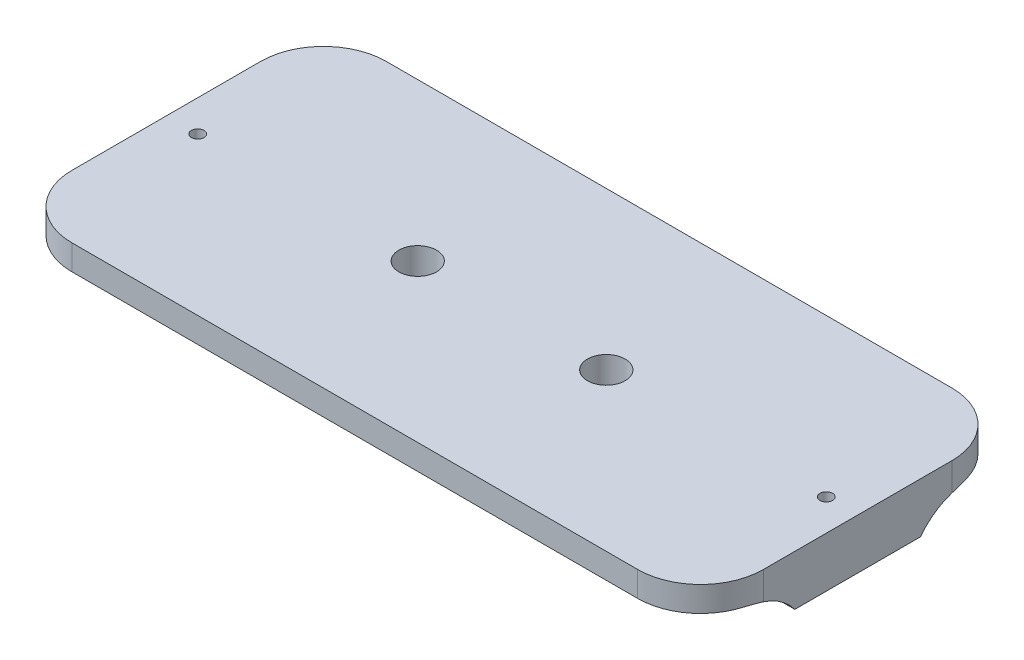
ISO-10303-21;
HEADER;
FILE_DESCRIPTION(('STEP AP214'),'2;1');
FILE_NAME('part.step','',(''),(''),'','','');
FILE_SCHEMA(('AUTOMOTIVE_DESIGN { 1 0 10303 214 1 1 1 1 }'));
ENDSEC;
DATA;
#1=APPLICATION_CONTEXT('core data for automotive mechanical design processes');
#2=APPLICATION_PROTOCOL_DEFINITION('international standard','automotive_design',2000,#1);
#3=PRODUCT_CONTEXT('',#1,'mechanical');
#4=PRODUCT('Part','Part','',(#3));
#5=PRODUCT_RELATED_PRODUCT_CATEGORY('part','',(#4));
#6=PRODUCT_DEFINITION_FORMATION('','',#4);
#7=PRODUCT_DEFINITION_CONTEXT('part definition',#1,'design');
#8=PRODUCT_DEFINITION('design','',#6,#7);
#9=PRODUCT_DEFINITION_SHAPE('','',#8);
#10=(LENGTH_UNIT() NAMED_UNIT(*) SI_UNIT(.MILLI.,.METRE.));
#11=(NAMED_UNIT(*) PLANE_ANGLE_UNIT() SI_UNIT($,.RADIAN.));
#12=(NAMED_UNIT(*) SI_UNIT($,.STERADIAN.) SOLID_ANGLE_UNIT());
#13=UNCERTAINTY_MEASURE_WITH_UNIT(LENGTH_MEASURE(1.E-05),#10,'distance_accuracy_value','');
#14=(GEOMETRIC_REPRESENTATION_CONTEXT(3) GLOBAL_UNCERTAINTY_ASSIGNED_CONTEXT((#13)) GLOBAL_UNIT_ASSIGNED_CONTEXT((#10,
#11,#12)) REPRESENTATION_CONTEXT('',''));
#15=CARTESIAN_POINT('',(0.,0.,0.));
#16=DIRECTION('',(0.,0.,1.));
#17=DIRECTION('',(1.,0.,0.));
#18=AXIS2_PLACEMENT_3D('',#15,#16,#17);
#19=CARTESIAN_POINT('',(0.,0.,0.));
#20=DIRECTION('',(0.,-1.,0.));
#21=DIRECTION('',(0.,0.,-1.));
#22=AXIS2_PLACEMENT_3D('',#19,#20,#21);
#23=PLANE('',#22);
#24=CARTESIAN_POINT('',(4.99999999999999,0.,-25.));
#25=DIRECTION('',(0.,1.,0.));
#26=DIRECTION('',(0.,0.,1.));
#27=AXIS2_PLACEMENT_3D('',#24,#25,#26);
#28=CIRCLE('',#27,1.);
#29=CARTESIAN_POINT('',(4.99999999999999,0.,-24.));
#30=VERTEX_POINT('',#29);
#31=EDGE_CURVE('E318',#30,#30,#28,.T.);
#32=ORIENTED_EDGE('',*,*,#31,.T.);
#33=EDGE_LOOP('',(#32));
#34=FACE_BOUND('',#33,.T.);
#35=CARTESIAN_POINT('',(105.,0.,-25.));
#36=DIRECTION('',(0.,1.,0.));
#37=DIRECTION('',(0.,0.,1.));
#38=AXIS2_PLACEMENT_3D('',#35,#36,#37);
#39=CIRCLE('',#38,0.999999999999998);
#40=CARTESIAN_POINT('',(105.,0.,-24.));
#41=VERTEX_POINT('',#40);
#42=EDGE_CURVE('E326',#41,#41,#39,.T.);
#43=ORIENTED_EDGE('',*,*,#42,.T.);
#44=EDGE_LOOP('',(#43));
#45=FACE_BOUND('',#44,.T.);
#46=CARTESIAN_POINT('',(70.,0.,-25.));
#47=DIRECTION('',(0.,1.,0.));
#48=DIRECTION('',(0.,0.,1.));
#49=AXIS2_PLACEMENT_3D('',#46,#47,#48);
#50=CIRCLE('',#49,1.75);
#51=CARTESIAN_POINT('',(70.,0.,-23.25));
#52=VERTEX_POINT('',#51);
#53=EDGE_CURVE('E300',#52,#52,#50,.T.);
#54=ORIENTED_EDGE('',*,*,#53,.T.);
#55=EDGE_LOOP('',(#54));
#56=FACE_BOUND('',#55,.T.);
#57=CARTESIAN_POINT('',(40.,0.,-25.));
#58=DIRECTION('',(0.,1.,0.));
#59=DIRECTION('',(0.,0.,1.));
#60=AXIS2_PLACEMENT_3D('',#57,#58,#59);
#61=CIRCLE('',#60,1.75);
#62=CARTESIAN_POINT('',(40.,0.,-23.25));
#63=VERTEX_POINT('',#62);
#64=EDGE_CURVE('E294',#63,#63,#61,.T.);
#65=ORIENTED_EDGE('',*,*,#64,.T.);
#66=EDGE_LOOP('',(#65));
#67=FACE_BOUND('',#66,.T.);
#68=DIRECTION('',(0.,0.,1.));
#69=VECTOR('',#68,1.);
#70=CARTESIAN_POINT('',(0.,0.,0.));
#71=LINE('',#70,#69);
#72=CARTESIAN_POINT('',(0.,0.,-35.));
#73=VERTEX_POINT('',#72);
#74=CARTESIAN_POINT('',(0.,0.,-15.));
#75=VERTEX_POINT('',#74);
#76=EDGE_CURVE('E141',#73,#75,#71,.T.);
#77=ORIENTED_EDGE('',*,*,#76,.F.);
#78=DIRECTION('',(-1.,0.,0.));
#79=VECTOR('',#78,1.);
#80=CARTESIAN_POINT('',(110.,0.,-35.));
#81=LINE('',#80,#79);
#82=CARTESIAN_POINT('',(110.,0.,-35.));
#83=VERTEX_POINT('',#82);
#84=EDGE_CURVE('E135',#83,#73,#81,.T.);
#85=ORIENTED_EDGE('',*,*,#84,.F.);
#86=DIRECTION('',(0.,0.,-1.));
#87=VECTOR('',#86,1.);
#88=CARTESIAN_POINT('',(110.,0.,0.));
#89=LINE('',#88,#87);
#90=CARTESIAN_POINT('',(110.,0.,-15.));
#91=VERTEX_POINT('',#90);
#92=EDGE_CURVE('E138',#91,#83,#89,.T.);
#93=ORIENTED_EDGE('',*,*,#92,.F.);
#94=DIRECTION('',(-1.,0.,0.));
#95=VECTOR('',#94,1.);
#96=CARTESIAN_POINT('',(110.,0.,-15.));
#97=LINE('',#96,#95);
#98=EDGE_CURVE('E246',#91,#75,#97,.T.);
#99=ORIENTED_EDGE('',*,*,#98,.T.);
#100=EDGE_LOOP('',(#77,#85,#93,#99));
#101=FACE_BOUND('',#100,.T.);
#102=ADVANCED_FACE('F39',(#34,#45,#56,#67,#101),#23,.T.);
#103=CARTESIAN_POINT('',(0.,8.,0.));
#104=DIRECTION('',(1.,0.,0.));
#105=DIRECTION('',(0.,0.,-1.));
#106=AXIS2_PLACEMENT_3D('',#103,#104,#105);
#107=PLANE('',#106);
#108=DIRECTION('',(0.,-1.,0.));
#109=VECTOR('',#108,1.);
#110=CARTESIAN_POINT('',(0.,8.,-40.));
#111=LINE('',#110,#109);
#112=CARTESIAN_POINT('',(0.,8.,-40.));
#113=VERTEX_POINT('',#112);
#114=CARTESIAN_POINT('',(0.,3.53939201416947,-40.));
#115=VERTEX_POINT('',#114);
#116=EDGE_CURVE('E67',#113,#115,#111,.T.);
#117=ORIENTED_EDGE('',*,*,#116,.T.);
#118=CARTESIAN_POINT('',(0.,-6.,-43.));
#119=DIRECTION('',(1.,0.,0.));
#120=DIRECTION('',(0.,0.,-1.));
#121=AXIS2_PLACEMENT_3D('',#118,#119,#120);
#122=CIRCLE('',#121,10.);
#123=EDGE_CURVE('E156',#115,#73,#122,.T.);
#124=ORIENTED_EDGE('',*,*,#123,.T.);
#125=ORIENTED_EDGE('',*,*,#76,.T.);
#126=CARTESIAN_POINT('',(0.,-6.,-7.));
#127=DIRECTION('',(1.,0.,0.));
#128=DIRECTION('',(0.,0.,-1.));
#129=AXIS2_PLACEMENT_3D('',#126,#127,#128);
#130=CIRCLE('',#129,10.);
#131=CARTESIAN_POINT('',(0.,3.53939201416947,-10.));
#132=VERTEX_POINT('',#131);
#133=EDGE_CURVE('E265',#75,#132,#130,.T.);
#134=ORIENTED_EDGE('',*,*,#133,.T.);
#135=DIRECTION('',(0.,-1.,0.));
#136=VECTOR('',#135,1.);
#137=CARTESIAN_POINT('',(0.,8.,-10.));
#138=LINE('',#137,#136);
#139=CARTESIAN_POINT('',(0.,8.,-10.));
#140=VERTEX_POINT('',#139);
#141=EDGE_CURVE('E270',#132,#140,#138,.F.);
#142=ORIENTED_EDGE('',*,*,#141,.T.);
#143=DIRECTION('',(0.,0.,1.));
#144=VECTOR('',#143,1.);
#145=CARTESIAN_POINT('',(0.,8.,0.));
#146=LINE('',#145,#144);
#147=EDGE_CURVE('E153',#113,#140,#146,.T.);
#148=ORIENTED_EDGE('',*,*,#147,.F.);
#149=EDGE_LOOP('',(#117,#124,#125,#134,#142,#148));
#150=FACE_BOUND('',#149,.T.);
#151=ADVANCED_FACE('F174',(#150),#107,.F.);
#152=CARTESIAN_POINT('',(0.,8.,0.));
#153=DIRECTION('',(0.,0.,-1.));
#154=DIRECTION('',(-1.,0.,0.));
#155=AXIS2_PLACEMENT_3D('',#152,#153,#154);
#156=PLANE('',#155);
#157=DIRECTION('',(-1.,0.,0.));
#158=VECTOR('',#157,1.);
#159=CARTESIAN_POINT('',(110.,4.,0.));
#160=LINE('',#159,#158);
#161=CARTESIAN_POINT('',(100.,4.,0.));
#162=VERTEX_POINT('',#161);
#163=CARTESIAN_POINT('',(10.,4.,0.));
#164=VERTEX_POINT('',#163);
#165=EDGE_CURVE('E146',#162,#164,#160,.T.);
#166=ORIENTED_EDGE('',*,*,#165,.F.);
#167=DIRECTION('',(0.,-1.,0.));
#168=VECTOR('',#167,1.);
#169=CARTESIAN_POINT('',(100.,8.,0.));
#170=LINE('',#169,#168);
#171=CARTESIAN_POINT('',(100.,8.,0.));
#172=VERTEX_POINT('',#171);
#173=EDGE_CURVE('E240',#162,#172,#170,.F.);
#174=ORIENTED_EDGE('',*,*,#173,.T.);
#175=DIRECTION('',(1.,0.,0.));
#176=VECTOR('',#175,1.);
#177=CARTESIAN_POINT('',(0.,8.,0.));
#178=LINE('',#177,#176);
#179=CARTESIAN_POINT('',(10.,8.,0.));
#180=VERTEX_POINT('',#179);
#181=EDGE_CURVE('E306',#180,#172,#178,.T.);
#182=ORIENTED_EDGE('',*,*,#181,.F.);
#183=DIRECTION('',(0.,-1.,0.));
#184=VECTOR('',#183,1.);
#185=CARTESIAN_POINT('',(10.,8.,0.));
#186=LINE('',#185,#184);
#187=EDGE_CURVE('E243',#180,#164,#186,.T.);
#188=ORIENTED_EDGE('',*,*,#187,.T.);
#189=EDGE_LOOP('',(#166,#174,#182,#188));
#190=FACE_BOUND('',#189,.T.);
#191=ADVANCED_FACE('F220',(#190),#156,.F.);
#192=CARTESIAN_POINT('',(110.,8.,0.));
#193=DIRECTION('',(-1.,0.,0.));
#194=DIRECTION('',(0.,0.,1.));
#195=AXIS2_PLACEMENT_3D('',#192,#193,#194);
#196=PLANE('',#195);
#197=ORIENTED_EDGE('',*,*,#92,.T.);
#198=CARTESIAN_POINT('',(110.,-6.,-43.));
#199=DIRECTION('',(-1.,0.,0.));
#200=DIRECTION('',(0.,0.,1.));
#201=AXIS2_PLACEMENT_3D('',#198,#199,#200);
#202=CIRCLE('',#201,10.);
#203=CARTESIAN_POINT('',(110.,3.53939201416947,-40.));
#204=VERTEX_POINT('',#203);
#205=EDGE_CURVE('E53',#83,#204,#202,.T.);
#206=ORIENTED_EDGE('',*,*,#205,.T.);
#207=DIRECTION('',(0.,-1.,0.));
#208=VECTOR('',#207,1.);
#209=CARTESIAN_POINT('',(110.,8.,-40.));
#210=LINE('',#209,#208);
#211=CARTESIAN_POINT('',(110.,8.,-40.));
#212=VERTEX_POINT('',#211);
#213=EDGE_CURVE('E59',#204,#212,#210,.F.);
#214=ORIENTED_EDGE('',*,*,#213,.T.);
#215=DIRECTION('',(0.,0.,-1.));
#216=VECTOR('',#215,1.);
#217=CARTESIAN_POINT('',(110.,8.,0.));
#218=LINE('',#217,#216);
#219=CARTESIAN_POINT('',(110.,8.,-10.));
#220=VERTEX_POINT('',#219);
#221=EDGE_CURVE('E303',#220,#212,#218,.T.);
#222=ORIENTED_EDGE('',*,*,#221,.F.);
#223=DIRECTION('',(0.,-1.,0.));
#224=VECTOR('',#223,1.);
#225=CARTESIAN_POINT('',(110.,8.,-10.));
#226=LINE('',#225,#224);
#227=CARTESIAN_POINT('',(110.,3.53939201416947,-10.));
#228=VERTEX_POINT('',#227);
#229=EDGE_CURVE('E272',#220,#228,#226,.T.);
#230=ORIENTED_EDGE('',*,*,#229,.T.);
#231=CARTESIAN_POINT('',(110.,-6.,-7.));
#232=DIRECTION('',(-1.,0.,0.));
#233=DIRECTION('',(0.,0.,1.));
#234=AXIS2_PLACEMENT_3D('',#231,#232,#233);
#235=CIRCLE('',#234,10.);
#236=EDGE_CURVE('E152',#228,#91,#235,.T.);
#237=ORIENTED_EDGE('',*,*,#236,.T.);
#238=EDGE_LOOP('',(#197,#206,#214,#222,#230,#237));
#239=FACE_BOUND('',#238,.T.);
#240=ADVANCED_FACE('F149',(#239),#196,.F.);
#241=CARTESIAN_POINT('',(0.,8.,-50.));
#242=DIRECTION('',(0.,0.,1.));
#243=DIRECTION('',(1.,0.,0.));
#244=AXIS2_PLACEMENT_3D('',#241,#242,#243);
#245=PLANE('',#244);
#246=DIRECTION('',(-1.,0.,0.));
#247=VECTOR('',#246,1.);
#248=CARTESIAN_POINT('',(110.,4.,-50.));
#249=LINE('',#248,#247);
#250=CARTESIAN_POINT('',(100.,4.,-50.));
#251=VERTEX_POINT('',#250);
#252=CARTESIAN_POINT('',(10.,4.,-50.));
#253=VERTEX_POINT('',#252);
#254=EDGE_CURVE('E145',#251,#253,#249,.T.);
#255=ORIENTED_EDGE('',*,*,#254,.T.);
#256=DIRECTION('',(0.,-1.,0.));
#257=VECTOR('',#256,1.);
#258=CARTESIAN_POINT('',(10.,8.,-50.));
#259=LINE('',#258,#257);
#260=CARTESIAN_POINT('',(10.,8.,-50.));
#261=VERTEX_POINT('',#260);
#262=EDGE_CURVE('E283',#253,#261,#259,.F.);
#263=ORIENTED_EDGE('',*,*,#262,.T.);
#264=DIRECTION('',(-1.,0.,0.));
#265=VECTOR('',#264,1.);
#266=CARTESIAN_POINT('',(0.,8.,-50.));
#267=LINE('',#266,#265);
#268=CARTESIAN_POINT('',(100.,8.,-50.));
#269=VERTEX_POINT('',#268);
#270=EDGE_CURVE('E290',#269,#261,#267,.T.);
#271=ORIENTED_EDGE('',*,*,#270,.F.);
#272=DIRECTION('',(0.,-1.,0.));
#273=VECTOR('',#272,1.);
#274=CARTESIAN_POINT('',(100.,8.,-50.));
#275=LINE('',#274,#273);
#276=EDGE_CURVE('E285',#269,#251,#275,.T.);
#277=ORIENTED_EDGE('',*,*,#276,.T.);
#278=EDGE_LOOP('',(#255,#263,#271,#277));
#279=FACE_BOUND('',#278,.T.);
#280=ADVANCED_FACE('F172',(#279),#245,.F.);
#281=CARTESIAN_POINT('',(10.,8.,-40.));
#282=DIRECTION('',(0.,-1.,0.));
#283=DIRECTION('',(0.,0.,-1.));
#284=AXIS2_PLACEMENT_3D('',#281,#282,#283);
#285=CYLINDRICAL_SURFACE('',#284,10.);
#286=ORIENTED_EDGE('',*,*,#262,.F.);
#287=CARTESIAN_POINT('',(10.,4.,-40.));
#288=DIRECTION('',(0.,-1.,0.));
#289=DIRECTION('',(0.,0.,-1.));
#290=AXIS2_PLACEMENT_3D('',#287,#288,#289);
#291=CIRCLE('',#290,10.);
#292=CARTESIAN_POINT('',(0.460607985830544,4.,-43.));
#293=VERTEX_POINT('',#292);
#294=EDGE_CURVE('E330',#253,#293,#291,.F.);
#295=ORIENTED_EDGE('',*,*,#294,.T.);
#296=CARTESIAN_POINT('',(0.460607985830544,4.,-43.));
#297=CARTESIAN_POINT('',(0.399025142829068,4.0000405640335,-42.804320186683));
#298=CARTESIAN_POINT('',(0.343535425482517,3.99425787386792,-42.6066976507177));
#299=CARTESIAN_POINT('',(0.244893932026724,3.97064691181748,-42.2089980375367));
#300=CARTESIAN_POINT('',(0.201748709899921,3.95281225809157,-42.0089197150555));
#301=CARTESIAN_POINT('',(0.128668115408528,3.90512454489427,-41.6115096057753));
#302=CARTESIAN_POINT('',(0.0985118085160332,3.8754904887217,-41.41419212497));
#303=CARTESIAN_POINT('',(0.050220717277287,3.80413806985401,-41.0203878642327));
#304=CARTESIAN_POINT('',(0.0320780372618352,3.76242767001008,-40.8239006231993));
#305=CARTESIAN_POINT('',(0.0131411393147966,3.68904076917667,-40.5232573811571));
#306=CARTESIAN_POINT('',(0.0082049888083644,3.66160261309225,-40.4182932070833));
#307=CARTESIAN_POINT('',(0.00162567355968928,3.60315487549351,-40.2087077034086));
#308=CARTESIAN_POINT('',(-1.33437205311071E-06,3.57212854901774,-40.10409053407));
#309=CARTESIAN_POINT('',(0.,3.53939201416946,-40.));
#310=B_SPLINE_CURVE_WITH_KNOTS('',3,(#296,#297,#298,#299,#300,#301,#302,#303,#304,#305,#306,
#307,#308,#309),.UNSPECIFIED.,.F.,.F.,(4,2,2,2,2,2,4),(0.,0.615282039656366,1.23089014338195,
1.83556840218196,2.43984885515918,2.76556374984206,3.09286515874298),.UNSPECIFIED.);
#311=EDGE_CURVE('E157',#293,#115,#310,.T.);
#312=ORIENTED_EDGE('',*,*,#311,.T.);
#313=ORIENTED_EDGE('',*,*,#116,.F.);
#314=CARTESIAN_POINT('',(10.,8.,-40.));
#315=DIRECTION('',(0.,-1.,0.));
#316=DIRECTION('',(0.,0.,-1.));
#317=AXIS2_PLACEMENT_3D('',#314,#315,#316);
#318=CIRCLE('',#317,10.);
#319=EDGE_CURVE('E274',#261,#113,#318,.F.);
#320=ORIENTED_EDGE('',*,*,#319,.F.);
#321=EDGE_LOOP('',(#286,#295,#312,#313,#320));
#322=FACE_BOUND('',#321,.T.);
#323=ADVANCED_FACE('F167',(#322),#285,.T.);
#324=CARTESIAN_POINT('',(100.,8.,-40.));
#325=DIRECTION('',(0.,-1.,0.));
#326=DIRECTION('',(0.,0.,-1.));
#327=AXIS2_PLACEMENT_3D('',#324,#325,#326);
#328=CYLINDRICAL_SURFACE('',#327,10.);
#329=ORIENTED_EDGE('',*,*,#213,.F.);
#330=CARTESIAN_POINT('',(110.,3.53939201416947,-40.));
#331=CARTESIAN_POINT('',(110.000040564033,3.60097485717094,-40.195679813317));
#332=CARTESIAN_POINT('',(109.994257873868,3.65646457451748,-40.3933023492823));
#333=CARTESIAN_POINT('',(109.970646911817,3.75510606797327,-40.7910019624633));
#334=CARTESIAN_POINT('',(109.952812258092,3.79825129010008,-40.9910802849445));
#335=CARTESIAN_POINT('',(109.905124544894,3.87133188459147,-41.3884903942247));
#336=CARTESIAN_POINT('',(109.875490488722,3.90148819148397,-41.58580787503));
#337=CARTESIAN_POINT('',(109.804138069854,3.94977928272271,-41.9796121357673));
#338=CARTESIAN_POINT('',(109.76242767001,3.96792196273816,-42.1760993768007));
#339=CARTESIAN_POINT('',(109.689040769177,3.9868588606852,-42.4767426188429));
#340=CARTESIAN_POINT('',(109.661602613092,3.99179501119164,-42.5817067929167));
#341=CARTESIAN_POINT('',(109.603154875494,3.99837432644031,-42.7912922965914));
#342=CARTESIAN_POINT('',(109.572128549018,4.00000133437205,-42.89590946593));
#343=CARTESIAN_POINT('',(109.539392014169,4.,-43.));
#344=B_SPLINE_CURVE_WITH_KNOTS('',3,(#330,#331,#332,#333,#334,#335,#336,#337,#338,#339,#340,
#341,#342,#343),.UNSPECIFIED.,.F.,.F.,(4,2,2,2,2,2,4),(0.,0.615282039656362,1.23089014338195,
1.83556840218196,2.43984885515918,2.76556374984206,3.09286515874299),.UNSPECIFIED.);
#345=CARTESIAN_POINT('',(109.539392014169,4.,-43.));
#346=VERTEX_POINT('',#345);
#347=EDGE_CURVE('E11',#204,#346,#344,.T.);
#348=ORIENTED_EDGE('',*,*,#347,.T.);
#349=CARTESIAN_POINT('',(100.,4.,-40.));
#350=DIRECTION('',(0.,-1.,0.));
#351=DIRECTION('',(0.,0.,-1.));
#352=AXIS2_PLACEMENT_3D('',#349,#350,#351);
#353=CIRCLE('',#352,10.);
#354=EDGE_CURVE('E255',#346,#251,#353,.F.);
#355=ORIENTED_EDGE('',*,*,#354,.T.);
#356=ORIENTED_EDGE('',*,*,#276,.F.);
#357=CARTESIAN_POINT('',(100.,8.,-40.));
#358=DIRECTION('',(0.,-1.,0.));
#359=DIRECTION('',(0.,0.,-1.));
#360=AXIS2_PLACEMENT_3D('',#357,#358,#359);
#361=CIRCLE('',#360,10.);
#362=EDGE_CURVE('E276',#212,#269,#361,.F.);
#363=ORIENTED_EDGE('',*,*,#362,.F.);
#364=EDGE_LOOP('',(#329,#348,#355,#356,#363));
#365=FACE_BOUND('',#364,.T.);
#366=ADVANCED_FACE('F171',(#365),#328,.T.);
#367=CARTESIAN_POINT('',(100.,8.,-10.));
#368=DIRECTION('',(0.,-1.,0.));
#369=DIRECTION('',(0.,0.,-1.));
#370=AXIS2_PLACEMENT_3D('',#367,#368,#369);
#371=CYLINDRICAL_SURFACE('',#370,10.);
#372=ORIENTED_EDGE('',*,*,#173,.F.);
#373=CARTESIAN_POINT('',(100.,4.,-10.));
#374=DIRECTION('',(0.,-1.,0.));
#375=DIRECTION('',(0.,0.,-1.));
#376=AXIS2_PLACEMENT_3D('',#373,#374,#375);
#377=CIRCLE('',#376,10.);
#378=CARTESIAN_POINT('',(109.539392014169,4.,-6.99999999999999));
#379=VERTEX_POINT('',#378);
#380=EDGE_CURVE('E250',#162,#379,#377,.F.);
#381=ORIENTED_EDGE('',*,*,#380,.T.);
#382=CARTESIAN_POINT('',(109.539392014169,4.,-7.));
#383=CARTESIAN_POINT('',(109.600974857171,4.00004056403349,-7.19567981331703));
#384=CARTESIAN_POINT('',(109.656464574517,3.99425787386792,-7.39330234928229));
#385=CARTESIAN_POINT('',(109.755106067973,3.97064691181748,-7.79100196246331));
#386=CARTESIAN_POINT('',(109.7982512901,3.95281225809157,-7.99108028494455));
#387=CARTESIAN_POINT('',(109.871331884591,3.90512454489427,-8.3884903942247));
#388=CARTESIAN_POINT('',(109.901488191484,3.8754904887217,-8.58580787502997));
#389=CARTESIAN_POINT('',(109.949779282723,3.80413806985401,-8.9796121357673));
#390=CARTESIAN_POINT('',(109.967921962738,3.76242767001008,-9.17609937680073));
#391=CARTESIAN_POINT('',(109.986858860685,3.68904076917667,-9.47674261884292));
#392=CARTESIAN_POINT('',(109.991795011192,3.66160261309225,-9.58170679291671));
#393=CARTESIAN_POINT('',(109.99837432644,3.60315487549351,-9.79129229659142));
#394=CARTESIAN_POINT('',(110.000001334372,3.57212854901774,-9.89590946593003));
#395=CARTESIAN_POINT('',(110.,3.53939201416946,-9.99999999999999));
#396=B_SPLINE_CURVE_WITH_KNOTS('',3,(#382,#383,#384,#385,#386,#387,#388,#389,#390,#391,#392,
#393,#394,#395),.UNSPECIFIED.,.F.,.F.,(4,2,2,2,2,2,4),(0.,0.615282039656373,1.23089014338196,
1.83556840218197,2.43984885515918,2.76556374984207,3.09286515874299),.UNSPECIFIED.);
#397=EDGE_CURVE('E186',#379,#228,#396,.T.);
#398=ORIENTED_EDGE('',*,*,#397,.T.);
#399=ORIENTED_EDGE('',*,*,#229,.F.);
#400=CARTESIAN_POINT('',(100.,8.,-10.));
#401=DIRECTION('',(0.,-1.,0.));
#402=DIRECTION('',(0.,0.,-1.));
#403=AXIS2_PLACEMENT_3D('',#400,#401,#402);
#404=CIRCLE('',#403,10.);
#405=EDGE_CURVE('E252',#172,#220,#404,.F.);
#406=ORIENTED_EDGE('',*,*,#405,.F.);
#407=EDGE_LOOP('',(#372,#381,#398,#399,#406));
#408=FACE_BOUND('',#407,.T.);
#409=ADVANCED_FACE('F179',(#408),#371,.T.);
#410=CARTESIAN_POINT('',(10.,8.,-10.));
#411=DIRECTION('',(0.,-1.,0.));
#412=DIRECTION('',(0.,0.,-1.));
#413=AXIS2_PLACEMENT_3D('',#410,#411,#412);
#414=CYLINDRICAL_SURFACE('',#413,10.);
#415=ORIENTED_EDGE('',*,*,#141,.F.);
#416=CARTESIAN_POINT('',(0.,3.53939201416947,-10.));
#417=CARTESIAN_POINT('',(-4.05640334945332E-05,3.60097485717094,-9.80432018668296));
#418=CARTESIAN_POINT('',(0.00574212613208105,3.65646457451749,-9.60669765071771));
#419=CARTESIAN_POINT('',(0.0293530881825251,3.75510606797328,-9.20899803753669));
#420=CARTESIAN_POINT('',(0.0471877419084313,3.79825129010008,-9.00891971505545));
#421=CARTESIAN_POINT('',(0.0948754551057295,3.87133188459147,-8.6115096057753));
#422=CARTESIAN_POINT('',(0.124509511278303,3.90148819148397,-8.41419212497003));
#423=CARTESIAN_POINT('',(0.195861930145989,3.94977928272271,-8.0203878642327));
#424=CARTESIAN_POINT('',(0.237572329989925,3.96792196273817,-7.82390062319926));
#425=CARTESIAN_POINT('',(0.310959230823332,3.9868588606852,-7.52325738115707));
#426=CARTESIAN_POINT('',(0.338397386907751,3.99179501119164,-7.41829320708328));
#427=CARTESIAN_POINT('',(0.396845124506494,3.99837432644031,-7.20870770340857));
#428=CARTESIAN_POINT('',(0.427871450982263,4.00000133437205,-7.10409053406996));
#429=CARTESIAN_POINT('',(0.460607985830544,4.,-6.99999999999999));
#430=B_SPLINE_CURVE_WITH_KNOTS('',3,(#416,#417,#418,#419,#420,#421,#422,#423,#424,#425,#426,
#427,#428,#429),.UNSPECIFIED.,.F.,.F.,(4,2,2,2,2,2,4),(0.,0.615282039656369,1.23089014338196,
1.83556840218196,2.43984885515918,2.76556374984207,3.09286515874299),.UNSPECIFIED.);
#431=CARTESIAN_POINT('',(0.460607985830546,4.,-7.));
#432=VERTEX_POINT('',#431);
#433=EDGE_CURVE('E193',#132,#432,#430,.T.);
#434=ORIENTED_EDGE('',*,*,#433,.T.);
#435=CARTESIAN_POINT('',(10.,4.,-10.));
#436=DIRECTION('',(0.,-1.,0.));
#437=DIRECTION('',(0.,0.,-1.));
#438=AXIS2_PLACEMENT_3D('',#435,#436,#437);
#439=CIRCLE('',#438,10.);
#440=EDGE_CURVE('E253',#432,#164,#439,.F.);
#441=ORIENTED_EDGE('',*,*,#440,.T.);
#442=ORIENTED_EDGE('',*,*,#187,.F.);
#443=CARTESIAN_POINT('',(10.,8.,-10.));
#444=DIRECTION('',(0.,-1.,0.));
#445=DIRECTION('',(0.,0.,-1.));
#446=AXIS2_PLACEMENT_3D('',#443,#444,#445);
#447=CIRCLE('',#446,10.);
#448=EDGE_CURVE('E281',#140,#180,#447,.F.);
#449=ORIENTED_EDGE('',*,*,#448,.F.);
#450=EDGE_LOOP('',(#415,#434,#441,#442,#449));
#451=FACE_BOUND('',#450,.T.);
#452=ADVANCED_FACE('F183',(#451),#414,.T.);
#453=CARTESIAN_POINT('',(70.,8.,-25.));
#454=DIRECTION('',(0.,-1.,0.));
#455=DIRECTION('',(0.,0.,-1.));
#456=AXIS2_PLACEMENT_3D('',#453,#454,#455);
#457=CYLINDRICAL_SURFACE('',#456,1.75);
#458=ORIENTED_EDGE('',*,*,#53,.F.);
#459=EDGE_LOOP('',(#458));
#460=FACE_BOUND('',#459,.T.);
#461=CARTESIAN_POINT('',(70.,3.,-25.));
#462=DIRECTION('',(0.,1.,0.));
#463=DIRECTION('',(0.,0.,1.));
#464=AXIS2_PLACEMENT_3D('',#461,#462,#463);
#465=CIRCLE('',#464,1.75);
#466=CARTESIAN_POINT('',(70.,3.,-23.25));
#467=VERTEX_POINT('',#466);
#468=EDGE_CURVE('E291',#467,#467,#465,.T.);
#469=ORIENTED_EDGE('',*,*,#468,.T.);
#470=EDGE_LOOP('',(#469));
#471=FACE_BOUND('',#470,.T.);
#472=ADVANCED_FACE('F362',(#460,#471),#457,.F.);
#473=CARTESIAN_POINT('',(40.,8.,-25.));
#474=DIRECTION('',(0.,-1.,0.));
#475=DIRECTION('',(0.,0.,-1.));
#476=AXIS2_PLACEMENT_3D('',#473,#474,#475);
#477=CYLINDRICAL_SURFACE('',#476,1.75);
#478=ORIENTED_EDGE('',*,*,#64,.F.);
#479=EDGE_LOOP('',(#478));
#480=FACE_BOUND('',#479,.T.);
#481=CARTESIAN_POINT('',(40.,3.,-25.));
#482=DIRECTION('',(0.,1.,0.));
#483=DIRECTION('',(0.,0.,1.));
#484=AXIS2_PLACEMENT_3D('',#481,#482,#483);
#485=CIRCLE('',#484,1.75);
#486=CARTESIAN_POINT('',(40.,3.,-23.25));
#487=VERTEX_POINT('',#486);
#488=EDGE_CURVE('E295',#487,#487,#485,.T.);
#489=ORIENTED_EDGE('',*,*,#488,.T.);
#490=EDGE_LOOP('',(#489));
#491=FACE_BOUND('',#490,.T.);
#492=ADVANCED_FACE('F351',(#480,#491),#477,.F.);
#493=CARTESIAN_POINT('',(0.,8.,0.));
#494=DIRECTION('',(0.,-1.,0.));
#495=DIRECTION('',(0.,0.,-1.));
#496=AXIS2_PLACEMENT_3D('',#493,#494,#495);
#497=PLANE('',#496);
#498=CARTESIAN_POINT('',(4.99999999999999,8.,-25.));
#499=DIRECTION('',(0.,1.,0.));
#500=DIRECTION('',(0.,0.,1.));
#501=AXIS2_PLACEMENT_3D('',#498,#499,#500);
#502=CIRCLE('',#501,1.);
#503=CARTESIAN_POINT('',(4.99999999999999,8.,-24.));
#504=VERTEX_POINT('',#503);
#505=EDGE_CURVE('E333',#504,#504,#502,.T.);
#506=ORIENTED_EDGE('',*,*,#505,.F.);
#507=EDGE_LOOP('',(#506));
#508=FACE_BOUND('',#507,.T.);
#509=CARTESIAN_POINT('',(105.,8.,-25.));
#510=DIRECTION('',(0.,1.,0.));
#511=DIRECTION('',(0.,0.,1.));
#512=AXIS2_PLACEMENT_3D('',#509,#510,#511);
#513=CIRCLE('',#512,0.999999999999998);
#514=CARTESIAN_POINT('',(105.,8.,-24.));
#515=VERTEX_POINT('',#514);
#516=EDGE_CURVE('E329',#515,#515,#513,.T.);
#517=ORIENTED_EDGE('',*,*,#516,.F.);
#518=EDGE_LOOP('',(#517));
#519=FACE_BOUND('',#518,.T.);
#520=CARTESIAN_POINT('',(70.,8.,-25.));
#521=DIRECTION('',(0.,1.,0.));
#522=DIRECTION('',(0.,0.,1.));
#523=AXIS2_PLACEMENT_3D('',#520,#521,#522);
#524=CIRCLE('',#523,3.00000000000001);
#525=CARTESIAN_POINT('',(70.,8.,-22.));
#526=VERTEX_POINT('',#525);
#527=EDGE_CURVE('E321',#526,#526,#524,.T.);
#528=ORIENTED_EDGE('',*,*,#527,.F.);
#529=EDGE_LOOP('',(#528));
#530=FACE_BOUND('',#529,.T.);
#531=CARTESIAN_POINT('',(40.,8.,-25.));
#532=DIRECTION('',(0.,1.,0.));
#533=DIRECTION('',(0.,0.,1.));
#534=AXIS2_PLACEMENT_3D('',#531,#532,#533);
#535=CIRCLE('',#534,3.);
#536=CARTESIAN_POINT('',(40.,8.,-22.));
#537=VERTEX_POINT('',#536);
#538=EDGE_CURVE('E317',#537,#537,#535,.T.);
#539=ORIENTED_EDGE('',*,*,#538,.F.);
#540=EDGE_LOOP('',(#539));
#541=FACE_BOUND('',#540,.T.);
#542=ORIENTED_EDGE('',*,*,#270,.T.);
#543=ORIENTED_EDGE('',*,*,#319,.T.);
#544=ORIENTED_EDGE('',*,*,#147,.T.);
#545=ORIENTED_EDGE('',*,*,#448,.T.);
#546=ORIENTED_EDGE('',*,*,#181,.T.);
#547=ORIENTED_EDGE('',*,*,#405,.T.);
#548=ORIENTED_EDGE('',*,*,#221,.T.);
#549=ORIENTED_EDGE('',*,*,#362,.T.);
#550=EDGE_LOOP('',(#542,#543,#544,#545,#546,#547,#548,#549));
#551=FACE_BOUND('',#550,.T.);
#552=ADVANCED_FACE('F225',(#508,#519,#530,#541,#551),#497,.F.);
#553=CARTESIAN_POINT('',(40.,3.,-25.));
#554=DIRECTION('',(0.,1.,0.));
#555=DIRECTION('',(0.,0.,1.));
#556=AXIS2_PLACEMENT_3D('',#553,#554,#555);
#557=CYLINDRICAL_SURFACE('',#556,3.);
#558=CARTESIAN_POINT('',(40.,3.,-25.));
#559=DIRECTION('',(0.,1.,0.));
#560=DIRECTION('',(0.,0.,1.));
#561=AXIS2_PLACEMENT_3D('',#558,#559,#560);
#562=CIRCLE('',#561,3.);
#563=CARTESIAN_POINT('',(40.,3.,-22.));
#564=VERTEX_POINT('',#563);
#565=EDGE_CURVE('E314',#564,#564,#562,.T.);
#566=ORIENTED_EDGE('',*,*,#565,.F.);
#567=EDGE_LOOP('',(#566));
#568=FACE_BOUND('',#567,.T.);
#569=ORIENTED_EDGE('',*,*,#538,.T.);
#570=EDGE_LOOP('',(#569));
#571=FACE_BOUND('',#570,.T.);
#572=ADVANCED_FACE('F350',(#568,#571),#557,.F.);
#573=CARTESIAN_POINT('',(40.,3.,-25.));
#574=DIRECTION('',(0.,1.,0.));
#575=DIRECTION('',(0.,0.,1.));
#576=AXIS2_PLACEMENT_3D('',#573,#574,#575);
#577=PLANE('',#576);
#578=ORIENTED_EDGE('',*,*,#488,.F.);
#579=EDGE_LOOP('',(#578));
#580=FACE_BOUND('',#579,.T.);
#581=ORIENTED_EDGE('',*,*,#565,.T.);
#582=EDGE_LOOP('',(#581));
#583=FACE_BOUND('',#582,.T.);
#584=ADVANCED_FACE('F358',(#580,#583),#577,.T.);
#585=CARTESIAN_POINT('',(70.,3.,-25.));
#586=DIRECTION('',(0.,1.,0.));
#587=DIRECTION('',(0.,0.,1.));
#588=AXIS2_PLACEMENT_3D('',#585,#586,#587);
#589=CYLINDRICAL_SURFACE('',#588,3.00000000000001);
#590=CARTESIAN_POINT('',(70.,3.,-25.));
#591=DIRECTION('',(0.,1.,0.));
#592=DIRECTION('',(0.,0.,1.));
#593=AXIS2_PLACEMENT_3D('',#590,#591,#592);
#594=CIRCLE('',#593,3.00000000000001);
#595=CARTESIAN_POINT('',(70.,3.,-22.));
#596=VERTEX_POINT('',#595);
#597=EDGE_CURVE('E297',#596,#596,#594,.T.);
#598=ORIENTED_EDGE('',*,*,#597,.F.);
#599=EDGE_LOOP('',(#598));
#600=FACE_BOUND('',#599,.T.);
#601=ORIENTED_EDGE('',*,*,#527,.T.);
#602=EDGE_LOOP('',(#601));
#603=FACE_BOUND('',#602,.T.);
#604=ADVANCED_FACE('F374',(#600,#603),#589,.F.);
#605=CARTESIAN_POINT('',(70.,3.,-25.));
#606=DIRECTION('',(0.,1.,0.));
#607=DIRECTION('',(0.,0.,1.));
#608=AXIS2_PLACEMENT_3D('',#605,#606,#607);
#609=PLANE('',#608);
#610=ORIENTED_EDGE('',*,*,#468,.F.);
#611=EDGE_LOOP('',(#610));
#612=FACE_BOUND('',#611,.T.);
#613=ORIENTED_EDGE('',*,*,#597,.T.);
#614=EDGE_LOOP('',(#613));
#615=FACE_BOUND('',#614,.T.);
#616=ADVANCED_FACE('F376',(#612,#615),#609,.T.);
#617=CARTESIAN_POINT('',(105.,0.,-25.));
#618=DIRECTION('',(0.,1.,0.));
#619=DIRECTION('',(0.,0.,1.));
#620=AXIS2_PLACEMENT_3D('',#617,#618,#619);
#621=CYLINDRICAL_SURFACE('',#620,0.999999999999998);
#622=ORIENTED_EDGE('',*,*,#42,.F.);
#623=EDGE_LOOP('',(#622));
#624=FACE_BOUND('',#623,.T.);
#625=ORIENTED_EDGE('',*,*,#516,.T.);
#626=EDGE_LOOP('',(#625));
#627=FACE_BOUND('',#626,.T.);
#628=ADVANCED_FACE('F382',(#624,#627),#621,.F.);
#629=CARTESIAN_POINT('',(4.99999999999999,0.,-25.));
#630=DIRECTION('',(0.,1.,0.));
#631=DIRECTION('',(0.,0.,1.));
#632=AXIS2_PLACEMENT_3D('',#629,#630,#631);
#633=CYLINDRICAL_SURFACE('',#632,1.);
#634=ORIENTED_EDGE('',*,*,#31,.F.);
#635=EDGE_LOOP('',(#634));
#636=FACE_BOUND('',#635,.T.);
#637=ORIENTED_EDGE('',*,*,#505,.T.);
#638=EDGE_LOOP('',(#637));
#639=FACE_BOUND('',#638,.T.);
#640=ADVANCED_FACE('F415',(#636,#639),#633,.F.);
#641=CARTESIAN_POINT('',(110.,4.,0.));
#642=DIRECTION('',(0.,-1.,0.));
#643=DIRECTION('',(0.,0.,-1.));
#644=AXIS2_PLACEMENT_3D('',#641,#642,#643);
#645=PLANE('',#644);
#646=ORIENTED_EDGE('',*,*,#440,.F.);
#647=DIRECTION('',(-1.,0.,0.));
#648=VECTOR('',#647,1.);
#649=CARTESIAN_POINT('',(110.,4.,-7.));
#650=LINE('',#649,#648);
#651=EDGE_CURVE('E261',#432,#379,#650,.F.);
#652=ORIENTED_EDGE('',*,*,#651,.T.);
#653=ORIENTED_EDGE('',*,*,#380,.F.);
#654=ORIENTED_EDGE('',*,*,#165,.T.);
#655=EDGE_LOOP('',(#646,#652,#653,#654));
#656=FACE_BOUND('',#655,.T.);
#657=ADVANCED_FACE('F209',(#656),#645,.T.);
#658=CARTESIAN_POINT('',(110.,4.,0.));
#659=DIRECTION('',(0.,-1.,0.));
#660=DIRECTION('',(0.,0.,-1.));
#661=AXIS2_PLACEMENT_3D('',#658,#659,#660);
#662=PLANE('',#661);
#663=ORIENTED_EDGE('',*,*,#354,.F.);
#664=DIRECTION('',(1.,0.,0.));
#665=VECTOR('',#664,1.);
#666=CARTESIAN_POINT('',(0.,4.,-43.));
#667=LINE('',#666,#665);
#668=EDGE_CURVE('E263',#346,#293,#667,.F.);
#669=ORIENTED_EDGE('',*,*,#668,.T.);
#670=ORIENTED_EDGE('',*,*,#294,.F.);
#671=ORIENTED_EDGE('',*,*,#254,.F.);
#672=EDGE_LOOP('',(#663,#669,#670,#671));
#673=FACE_BOUND('',#672,.T.);
#674=ADVANCED_FACE('F202',(#673),#662,.T.);
#675=CARTESIAN_POINT('',(110.,-6.,-7.));
#676=DIRECTION('',(1.,0.,0.));
#677=DIRECTION('',(0.,0.,-1.));
#678=AXIS2_PLACEMENT_3D('',#675,#676,#677);
#679=CYLINDRICAL_SURFACE('',#678,10.);
#680=ORIENTED_EDGE('',*,*,#397,.F.);
#681=ORIENTED_EDGE('',*,*,#651,.F.);
#682=ORIENTED_EDGE('',*,*,#433,.F.);
#683=ORIENTED_EDGE('',*,*,#133,.F.);
#684=ORIENTED_EDGE('',*,*,#98,.F.);
#685=ORIENTED_EDGE('',*,*,#236,.F.);
#686=EDGE_LOOP('',(#680,#681,#682,#683,#684,#685));
#687=FACE_BOUND('',#686,.T.);
#688=ADVANCED_FACE('F199',(#687),#679,.F.);
#689=CARTESIAN_POINT('',(110.,-6.,-43.));
#690=DIRECTION('',(-1.,0.,0.));
#691=DIRECTION('',(0.,0.,1.));
#692=AXIS2_PLACEMENT_3D('',#689,#690,#691);
#693=CYLINDRICAL_SURFACE('',#692,10.);
#694=ORIENTED_EDGE('',*,*,#205,.F.);
#695=ORIENTED_EDGE('',*,*,#84,.T.);
#696=ORIENTED_EDGE('',*,*,#123,.F.);
#697=ORIENTED_EDGE('',*,*,#311,.F.);
#698=ORIENTED_EDGE('',*,*,#668,.F.);
#699=ORIENTED_EDGE('',*,*,#347,.F.);
#700=EDGE_LOOP('',(#694,#695,#696,#697,#698,#699));
#701=FACE_BOUND('',#700,.T.);
#702=ADVANCED_FACE('F41',(#701),#693,.F.);
#703=CLOSED_SHELL('',(#102,#151,#191,#240,#280,#323,#366,#409,#452,#472,#492,#552,#572,#584,
#604,#616,#628,#640,#657,#674,#688,#702));
#704=MANIFOLD_SOLID_BREP('B2',#703);
#705=ADVANCED_BREP_SHAPE_REPRESENTATION('',(#18,#704),#14);
#706=SHAPE_DEFINITION_REPRESENTATION(#9,#705);
ENDSEC;
END-ISO-10303-21;
